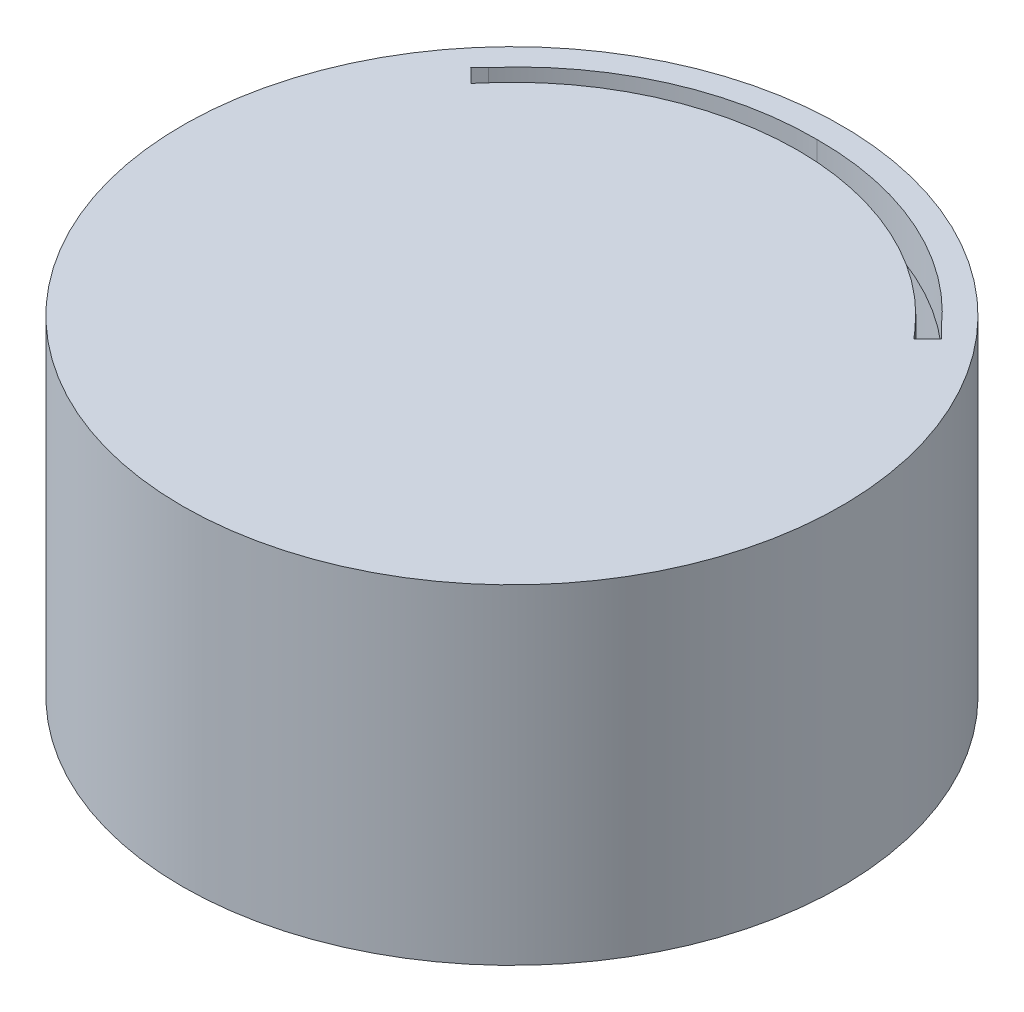
ISO-10303-21;
HEADER;
FILE_DESCRIPTION(('STEP AP214'),'2;1');
FILE_NAME('part.step','',(''),(''),'','','');
FILE_SCHEMA(('AUTOMOTIVE_DESIGN { 1 0 10303 214 1 1 1 1 }'));
ENDSEC;
DATA;
#1=APPLICATION_CONTEXT('core data for automotive mechanical design processes');
#2=APPLICATION_PROTOCOL_DEFINITION('international standard','automotive_design',2000,#1);
#3=PRODUCT_CONTEXT('',#1,'mechanical');
#4=PRODUCT('Part','Part','',(#3));
#5=PRODUCT_RELATED_PRODUCT_CATEGORY('part','',(#4));
#6=PRODUCT_DEFINITION_FORMATION('','',#4);
#7=PRODUCT_DEFINITION_CONTEXT('part definition',#1,'design');
#8=PRODUCT_DEFINITION('design','',#6,#7);
#9=PRODUCT_DEFINITION_SHAPE('','',#8);
#10=(LENGTH_UNIT() NAMED_UNIT(*) SI_UNIT(.MILLI.,.METRE.));
#11=(NAMED_UNIT(*) PLANE_ANGLE_UNIT() SI_UNIT($,.RADIAN.));
#12=(NAMED_UNIT(*) SI_UNIT($,.STERADIAN.) SOLID_ANGLE_UNIT());
#13=UNCERTAINTY_MEASURE_WITH_UNIT(LENGTH_MEASURE(1.E-05),#10,'distance_accuracy_value','');
#14=(GEOMETRIC_REPRESENTATION_CONTEXT(3) GLOBAL_UNCERTAINTY_ASSIGNED_CONTEXT((#13)) GLOBAL_UNIT_ASSIGNED_CONTEXT((#10,
#11,#12)) REPRESENTATION_CONTEXT('',''));
#15=CARTESIAN_POINT('',(0.,0.,0.));
#16=DIRECTION('',(0.,0.,1.));
#17=DIRECTION('',(1.,0.,0.));
#18=AXIS2_PLACEMENT_3D('',#15,#16,#17);
#19=CARTESIAN_POINT('',(0.,30.,0.));
#20=DIRECTION('',(0.,1.,0.));
#21=DIRECTION('',(0.,0.,1.));
#22=AXIS2_PLACEMENT_3D('',#19,#20,#21);
#23=PLANE('',#22);
#24=CARTESIAN_POINT('',(0.,30.,0.));
#25=DIRECTION('',(0.,1.,0.));
#26=DIRECTION('',(0.,0.,1.));
#27=AXIS2_PLACEMENT_3D('',#24,#25,#26);
#28=CIRCLE('',#27,30.);
#29=CARTESIAN_POINT('',(0.,30.,30.));
#30=VERTEX_POINT('',#29);
#31=EDGE_CURVE('E150',#30,#30,#28,.T.);
#32=ORIENTED_EDGE('',*,*,#31,.T.);
#33=EDGE_LOOP('',(#32));
#34=FACE_BOUND('',#33,.T.);
#35=CARTESIAN_POINT('',(-0.269476232128927,30.,-0.813193995065218));
#36=DIRECTION('',(0.,1.,0.));
#37=DIRECTION('',(0.,0.,1.));
#38=AXIS2_PLACEMENT_3D('',#35,#36,#37);
#39=CIRCLE('',#38,26.9706805768212);
#40=CARTESIAN_POINT('',(-0.0254023069730041,30.,-27.7827701633327));
#41=VERTEX_POINT('',#40);
#42=CARTESIAN_POINT('',(-20.6220749338951,30.,-18.5103501751351));
#43=VERTEX_POINT('',#42);
#44=EDGE_CURVE('E126',#41,#43,#39,.T.);
#45=ORIENTED_EDGE('',*,*,#44,.F.);
#46=CARTESIAN_POINT('',(0.218671618182906,30.,-0.813193995065218));
#47=DIRECTION('',(0.,1.,0.));
#48=DIRECTION('',(0.,0.,1.));
#49=AXIS2_PLACEMENT_3D('',#46,#47,#48);
#50=CIRCLE('',#49,26.9706805768212);
#51=CARTESIAN_POINT('',(20.5712703199491,30.,-18.5103501751351));
#52=VERTEX_POINT('',#51);
#53=EDGE_CURVE('E114',#41,#52,#50,.F.);
#54=ORIENTED_EDGE('',*,*,#53,.T.);
#55=DIRECTION('',(-0.707106781186542,0.,-0.707106781186554));
#56=VECTOR('',#55,1.);
#57=CARTESIAN_POINT('',(19.5408102475423,30.,-19.540810247542));
#58=LINE('',#57,#56);
#59=CARTESIAN_POINT('',(21.3902384528601,30.,-17.6913820422241));
#60=VERTEX_POINT('',#59);
#61=EDGE_CURVE('E120',#60,#52,#58,.T.);
#62=ORIENTED_EDGE('',*,*,#61,.F.);
#63=DIRECTION('',(-0.715524800333269,0.,0.698587331768932));
#64=VECTOR('',#63,1.);
#65=CARTESIAN_POINT('',(1.59580190612503,30.,1.63449262293414));
#66=LINE('',#65,#64);
#67=CARTESIAN_POINT('',(20.1244711318793,30.,-16.4555771966164));
#68=VERTEX_POINT('',#67);
#69=EDGE_CURVE('E210',#60,#68,#66,.T.);
#70=ORIENTED_EDGE('',*,*,#69,.T.);
#71=DIRECTION('',(-0.654896156385466,0.,-0.755718879181633));
#72=VECTOR('',#71,1.);
#73=CARTESIAN_POINT('',(19.6374586279711,30.,-17.0175663608715));
#74=LINE('',#73,#72);
#75=CARTESIAN_POINT('',(19.5005232357283,30.,-17.1755832619283));
#76=VERTEX_POINT('',#75);
#77=EDGE_CURVE('E214',#68,#76,#74,.T.);
#78=ORIENTED_EDGE('',*,*,#77,.T.);
#79=CARTESIAN_POINT('',(-0.0653695292751055,30.,-0.0864662667465453));
#80=DIRECTION('',(0.,1.,0.));
#81=DIRECTION('',(0.,0.,1.));
#82=AXIS2_PLACEMENT_3D('',#79,#80,#81);
#83=CIRCLE('',#82,25.978107694107);
#84=CARTESIAN_POINT('',(-0.0254023069730072,30.,-26.0645432161238));
#85=VERTEX_POINT('',#84);
#86=EDGE_CURVE('E218',#85,#76,#83,.F.);
#87=ORIENTED_EDGE('',*,*,#86,.F.);
#88=CARTESIAN_POINT('',(0.014564915329085,30.,-0.0864662667465453));
#89=DIRECTION('',(0.,1.,0.));
#90=DIRECTION('',(0.,0.,1.));
#91=AXIS2_PLACEMENT_3D('',#88,#89,#90);
#92=CIRCLE('',#91,25.978107694107);
#93=CARTESIAN_POINT('',(-19.5513278496743,30.,-17.1755832619283));
#94=VERTEX_POINT('',#93);
#95=EDGE_CURVE('E221',#85,#94,#92,.T.);
#96=ORIENTED_EDGE('',*,*,#95,.T.);
#97=DIRECTION('',(0.654896156385466,0.,-0.755718879181633));
#98=VECTOR('',#97,1.);
#99=CARTESIAN_POINT('',(-19.6664737030836,30.,-17.0427104477693));
#100=LINE('',#99,#98);
#101=CARTESIAN_POINT('',(-20.1752757458253,30.,-16.4555771966164));
#102=VERTEX_POINT('',#101);
#103=EDGE_CURVE('E225',#102,#94,#100,.T.);
#104=ORIENTED_EDGE('',*,*,#103,.F.);
#105=DIRECTION('',(0.715524800333269,0.,0.698587331768932));
#106=VECTOR('',#105,1.);
#107=CARTESIAN_POINT('',(-1.62059579025611,30.,1.65988764254816));
#108=LINE('',#107,#106);
#109=CARTESIAN_POINT('',(-21.4410430668062,30.,-17.6913820422241));
#110=VERTEX_POINT('',#109);
#111=EDGE_CURVE('E142',#110,#102,#108,.T.);
#112=ORIENTED_EDGE('',*,*,#111,.F.);
#113=DIRECTION('',(0.707106781186542,0.,-0.707106781186554));
#114=VECTOR('',#113,1.);
#115=CARTESIAN_POINT('',(-19.5662125545153,30.,-19.566212554515));
#116=LINE('',#115,#114);
#117=EDGE_CURVE('E133',#110,#43,#116,.T.);
#118=ORIENTED_EDGE('',*,*,#117,.T.);
#119=EDGE_LOOP('',(#45,#54,#62,#70,#78,#87,#96,#104,#112,#118));
#120=FACE_BOUND('',#119,.T.);
#121=ADVANCED_FACE('F39',(#34,#120),#23,.T.);
#122=CARTESIAN_POINT('',(0.,26.,0.));
#123=DIRECTION('',(0.,1.,0.));
#124=DIRECTION('',(0.,0.,1.));
#125=AXIS2_PLACEMENT_3D('',#122,#123,#124);
#126=PLANE('',#125);
#127=CARTESIAN_POINT('',(0.,26.,0.));
#128=DIRECTION('',(0.,1.,0.));
#129=DIRECTION('',(0.,0.,1.));
#130=AXIS2_PLACEMENT_3D('',#127,#128,#129);
#131=CIRCLE('',#130,29.);
#132=CARTESIAN_POINT('',(0.,26.,29.));
#133=VERTEX_POINT('',#132);
#134=EDGE_CURVE('E140',#133,#133,#131,.T.);
#135=ORIENTED_EDGE('',*,*,#134,.F.);
#136=EDGE_LOOP('',(#135));
#137=FACE_BOUND('',#136,.T.);
#138=CARTESIAN_POINT('',(0.218671618182906,26.,-0.813193995065218));
#139=DIRECTION('',(0.,1.,0.));
#140=DIRECTION('',(0.,0.,1.));
#141=AXIS2_PLACEMENT_3D('',#138,#139,#140);
#142=CIRCLE('',#141,26.9706805768212);
#143=CARTESIAN_POINT('',(-0.0254023069730041,26.,-27.7827701633327));
#144=VERTEX_POINT('',#143);
#145=CARTESIAN_POINT('',(20.5712703199491,26.,-18.5103501751351));
#146=VERTEX_POINT('',#145);
#147=EDGE_CURVE('E154',#144,#146,#142,.F.);
#148=ORIENTED_EDGE('',*,*,#147,.F.);
#149=CARTESIAN_POINT('',(-0.269476232128927,26.,-0.813193995065218));
#150=DIRECTION('',(0.,1.,0.));
#151=DIRECTION('',(0.,0.,1.));
#152=AXIS2_PLACEMENT_3D('',#149,#150,#151);
#153=CIRCLE('',#152,26.9706805768212);
#154=CARTESIAN_POINT('',(-20.6220749338951,26.,-18.5103501751351));
#155=VERTEX_POINT('',#154);
#156=EDGE_CURVE('E11',#144,#155,#153,.T.);
#157=ORIENTED_EDGE('',*,*,#156,.T.);
#158=DIRECTION('',(0.707106781186542,0.,-0.707106781186554));
#159=VECTOR('',#158,1.);
#160=CARTESIAN_POINT('',(-19.5662125545153,26.,-19.566212554515));
#161=LINE('',#160,#159);
#162=CARTESIAN_POINT('',(-21.4410430668062,26.,-17.6913820422241));
#163=VERTEX_POINT('',#162);
#164=EDGE_CURVE('E48',#163,#155,#161,.T.);
#165=ORIENTED_EDGE('',*,*,#164,.F.);
#166=DIRECTION('',(0.715524800333269,0.,0.698587331768932));
#167=VECTOR('',#166,1.);
#168=CARTESIAN_POINT('',(-1.62059579025611,26.,1.65988764254816));
#169=LINE('',#168,#167);
#170=CARTESIAN_POINT('',(-20.1752757458253,26.,-16.4555771966164));
#171=VERTEX_POINT('',#170);
#172=EDGE_CURVE('E181',#163,#171,#169,.T.);
#173=ORIENTED_EDGE('',*,*,#172,.T.);
#174=DIRECTION('',(0.654896156385466,0.,-0.755718879181633));
#175=VECTOR('',#174,1.);
#176=CARTESIAN_POINT('',(-19.6664737030836,26.,-17.0427104477693));
#177=LINE('',#176,#175);
#178=CARTESIAN_POINT('',(-19.5513278496743,26.,-17.1755832619283));
#179=VERTEX_POINT('',#178);
#180=EDGE_CURVE('E177',#171,#179,#177,.T.);
#181=ORIENTED_EDGE('',*,*,#180,.T.);
#182=CARTESIAN_POINT('',(0.014564915329085,26.,-0.0864662667465453));
#183=DIRECTION('',(0.,1.,0.));
#184=DIRECTION('',(0.,0.,1.));
#185=AXIS2_PLACEMENT_3D('',#182,#183,#184);
#186=CIRCLE('',#185,25.978107694107);
#187=CARTESIAN_POINT('',(-0.0254023069730072,26.,-26.0645432161238));
#188=VERTEX_POINT('',#187);
#189=EDGE_CURVE('E174',#188,#179,#186,.T.);
#190=ORIENTED_EDGE('',*,*,#189,.F.);
#191=CARTESIAN_POINT('',(-0.0653695292751055,26.,-0.0864662667465453));
#192=DIRECTION('',(0.,1.,0.));
#193=DIRECTION('',(0.,0.,1.));
#194=AXIS2_PLACEMENT_3D('',#191,#192,#193);
#195=CIRCLE('',#194,25.978107694107);
#196=CARTESIAN_POINT('',(19.5005232357283,26.,-17.1755832619283));
#197=VERTEX_POINT('',#196);
#198=EDGE_CURVE('E170',#188,#197,#195,.F.);
#199=ORIENTED_EDGE('',*,*,#198,.T.);
#200=DIRECTION('',(-0.654896156385466,0.,-0.755718879181633));
#201=VECTOR('',#200,1.);
#202=CARTESIAN_POINT('',(19.6374586279711,26.,-17.0175663608715));
#203=LINE('',#202,#201);
#204=CARTESIAN_POINT('',(20.1244711318793,26.,-16.4555771966164));
#205=VERTEX_POINT('',#204);
#206=EDGE_CURVE('E167',#205,#197,#203,.T.);
#207=ORIENTED_EDGE('',*,*,#206,.F.);
#208=DIRECTION('',(-0.715524800333269,0.,0.698587331768932));
#209=VECTOR('',#208,1.);
#210=CARTESIAN_POINT('',(1.59580190612503,26.,1.63449262293414));
#211=LINE('',#210,#209);
#212=CARTESIAN_POINT('',(21.3902384528601,26.,-17.6913820422241));
#213=VERTEX_POINT('',#212);
#214=EDGE_CURVE('E164',#213,#205,#211,.T.);
#215=ORIENTED_EDGE('',*,*,#214,.F.);
#216=DIRECTION('',(-0.707106781186542,0.,-0.707106781186554));
#217=VECTOR('',#216,1.);
#218=CARTESIAN_POINT('',(19.5408102475423,26.,-19.540810247542));
#219=LINE('',#218,#217);
#220=EDGE_CURVE('E160',#213,#146,#219,.T.);
#221=ORIENTED_EDGE('',*,*,#220,.T.);
#222=EDGE_LOOP('',(#148,#157,#165,#173,#181,#190,#199,#207,#215,#221));
#223=FACE_BOUND('',#222,.T.);
#224=ADVANCED_FACE('F194',(#137,#223),#126,.F.);
#225=CARTESIAN_POINT('',(0.,30.,0.));
#226=DIRECTION('',(0.,-1.,0.));
#227=DIRECTION('',(0.,0.,-1.));
#228=AXIS2_PLACEMENT_3D('',#225,#226,#227);
#229=CYLINDRICAL_SURFACE('',#228,30.);
#230=ORIENTED_EDGE('',*,*,#31,.F.);
#231=EDGE_LOOP('',(#230));
#232=FACE_BOUND('',#231,.T.);
#233=CARTESIAN_POINT('',(0.,0.,0.));
#234=DIRECTION('',(0.,1.,0.));
#235=DIRECTION('',(0.,0.,1.));
#236=AXIS2_PLACEMENT_3D('',#233,#234,#235);
#237=CIRCLE('',#236,30.);
#238=CARTESIAN_POINT('',(0.,0.,30.));
#239=VERTEX_POINT('',#238);
#240=EDGE_CURVE('E148',#239,#239,#237,.T.);
#241=ORIENTED_EDGE('',*,*,#240,.T.);
#242=EDGE_LOOP('',(#241));
#243=FACE_BOUND('',#242,.T.);
#244=ADVANCED_FACE('F41',(#232,#243),#229,.T.);
#245=CARTESIAN_POINT('',(0.,0.,0.));
#246=DIRECTION('',(0.,1.,0.));
#247=DIRECTION('',(0.,0.,1.));
#248=AXIS2_PLACEMENT_3D('',#245,#246,#247);
#249=PLANE('',#248);
#250=CARTESIAN_POINT('',(0.,0.,0.));
#251=DIRECTION('',(0.,1.,0.));
#252=DIRECTION('',(0.,0.,1.));
#253=AXIS2_PLACEMENT_3D('',#250,#251,#252);
#254=CIRCLE('',#253,29.);
#255=CARTESIAN_POINT('',(0.,0.,29.));
#256=VERTEX_POINT('',#255);
#257=EDGE_CURVE('E135',#256,#256,#254,.T.);
#258=ORIENTED_EDGE('',*,*,#257,.T.);
#259=EDGE_LOOP('',(#258));
#260=FACE_BOUND('',#259,.T.);
#261=ORIENTED_EDGE('',*,*,#240,.F.);
#262=EDGE_LOOP('',(#261));
#263=FACE_BOUND('',#262,.T.);
#264=ADVANCED_FACE('F285',(#260,#263),#249,.F.);
#265=CARTESIAN_POINT('',(0.,26.,0.));
#266=DIRECTION('',(0.,-1.,0.));
#267=DIRECTION('',(0.,0.,-1.));
#268=AXIS2_PLACEMENT_3D('',#265,#266,#267);
#269=CYLINDRICAL_SURFACE('',#268,29.);
#270=ORIENTED_EDGE('',*,*,#134,.T.);
#271=EDGE_LOOP('',(#270));
#272=FACE_BOUND('',#271,.T.);
#273=ORIENTED_EDGE('',*,*,#257,.F.);
#274=EDGE_LOOP('',(#273));
#275=FACE_BOUND('',#274,.T.);
#276=ADVANCED_FACE('F284',(#272,#275),#269,.F.);
#277=CARTESIAN_POINT('',(-0.269476232128927,74.,-0.813193995065218));
#278=DIRECTION('',(0.,-1.,0.));
#279=DIRECTION('',(0.,0.,-1.));
#280=AXIS2_PLACEMENT_3D('',#277,#278,#279);
#281=CYLINDRICAL_SURFACE('',#280,26.9706805768212);
#282=ORIENTED_EDGE('',*,*,#44,.T.);
#283=DIRECTION('',(0.,-1.,0.));
#284=VECTOR('',#283,1.);
#285=CARTESIAN_POINT('',(-20.6220749338951,74.,-18.5103501751351));
#286=LINE('',#285,#284);
#287=EDGE_CURVE('E121',#43,#155,#286,.T.);
#288=ORIENTED_EDGE('',*,*,#287,.T.);
#289=ORIENTED_EDGE('',*,*,#156,.F.);
#290=DIRECTION('',(0.,-1.,0.));
#291=VECTOR('',#290,1.);
#292=CARTESIAN_POINT('',(-0.0254023069730041,74.,-27.7827701633327));
#293=LINE('',#292,#291);
#294=EDGE_CURVE('E60',#41,#144,#293,.T.);
#295=ORIENTED_EDGE('',*,*,#294,.F.);
#296=EDGE_LOOP('',(#282,#288,#289,#295));
#297=FACE_BOUND('',#296,.T.);
#298=ADVANCED_FACE('F124',(#297),#281,.F.);
#299=CARTESIAN_POINT('',(-20.6220749338951,74.,-18.5103501751351));
#300=DIRECTION('',(0.707106781186554,0.,0.707106781186542));
#301=DIRECTION('',(0.707106781186542,0.,-0.707106781186554));
#302=AXIS2_PLACEMENT_3D('',#299,#300,#301);
#303=PLANE('',#302);
#304=DIRECTION('',(0.,-1.,0.));
#305=VECTOR('',#304,1.);
#306=CARTESIAN_POINT('',(-21.4410430668062,74.,-17.6913820422241));
#307=LINE('',#306,#305);
#308=EDGE_CURVE('E190',#110,#163,#307,.T.);
#309=ORIENTED_EDGE('',*,*,#308,.T.);
#310=ORIENTED_EDGE('',*,*,#164,.T.);
#311=ORIENTED_EDGE('',*,*,#287,.F.);
#312=ORIENTED_EDGE('',*,*,#117,.F.);
#313=EDGE_LOOP('',(#309,#310,#311,#312));
#314=FACE_BOUND('',#313,.T.);
#315=ADVANCED_FACE('F188',(#314),#303,.T.);
#316=CARTESIAN_POINT('',(-20.1752757458253,74.,-16.4555771966164));
#317=DIRECTION('',(-0.698587331768932,0.,0.715524800333269));
#318=DIRECTION('',(0.715524800333269,0.,0.698587331768932));
#319=AXIS2_PLACEMENT_3D('',#316,#317,#318);
#320=PLANE('',#319);
#321=ORIENTED_EDGE('',*,*,#111,.T.);
#322=DIRECTION('',(0.,-1.,0.));
#323=VECTOR('',#322,1.);
#324=CARTESIAN_POINT('',(-20.1752757458253,74.,-16.4555771966164));
#325=LINE('',#324,#323);
#326=EDGE_CURVE('E232',#102,#171,#325,.T.);
#327=ORIENTED_EDGE('',*,*,#326,.T.);
#328=ORIENTED_EDGE('',*,*,#172,.F.);
#329=ORIENTED_EDGE('',*,*,#308,.F.);
#330=EDGE_LOOP('',(#321,#327,#328,#329));
#331=FACE_BOUND('',#330,.T.);
#332=ADVANCED_FACE('F231',(#331),#320,.F.);
#333=CARTESIAN_POINT('',(-19.5513278496743,74.,-17.1755832619283));
#334=DIRECTION('',(0.755718879181633,0.,0.654896156385466));
#335=DIRECTION('',(0.654896156385466,0.,-0.755718879181633));
#336=AXIS2_PLACEMENT_3D('',#333,#334,#335);
#337=PLANE('',#336);
#338=ORIENTED_EDGE('',*,*,#103,.T.);
#339=DIRECTION('',(0.,-1.,0.));
#340=VECTOR('',#339,1.);
#341=CARTESIAN_POINT('',(-19.5513278496743,74.,-17.1755832619283));
#342=LINE('',#341,#340);
#343=EDGE_CURVE('E239',#94,#179,#342,.T.);
#344=ORIENTED_EDGE('',*,*,#343,.T.);
#345=ORIENTED_EDGE('',*,*,#180,.F.);
#346=ORIENTED_EDGE('',*,*,#326,.F.);
#347=EDGE_LOOP('',(#338,#344,#345,#346));
#348=FACE_BOUND('',#347,.T.);
#349=ADVANCED_FACE('F235',(#348),#337,.F.);
#350=CARTESIAN_POINT('',(0.014564915329085,74.,-0.0864662667465453));
#351=DIRECTION('',(0.,-1.,0.));
#352=DIRECTION('',(0.,0.,-1.));
#353=AXIS2_PLACEMENT_3D('',#350,#351,#352);
#354=CYLINDRICAL_SURFACE('',#353,25.978107694107);
#355=DIRECTION('',(0.,-1.,0.));
#356=VECTOR('',#355,1.);
#357=CARTESIAN_POINT('',(-0.0254023069730072,74.,-26.0645432161238));
#358=LINE('',#357,#356);
#359=EDGE_CURVE('E246',#85,#188,#358,.T.);
#360=ORIENTED_EDGE('',*,*,#359,.T.);
#361=ORIENTED_EDGE('',*,*,#189,.T.);
#362=ORIENTED_EDGE('',*,*,#343,.F.);
#363=ORIENTED_EDGE('',*,*,#95,.F.);
#364=EDGE_LOOP('',(#360,#361,#362,#363));
#365=FACE_BOUND('',#364,.T.);
#366=ADVANCED_FACE('F245',(#365),#354,.T.);
#367=CARTESIAN_POINT('',(-0.0653695292751055,74.,-0.0864662667465453));
#368=DIRECTION('',(0.,-1.,0.));
#369=DIRECTION('',(0.,0.,-1.));
#370=AXIS2_PLACEMENT_3D('',#367,#368,#369);
#371=CYLINDRICAL_SURFACE('',#370,25.978107694107);
#372=ORIENTED_EDGE('',*,*,#86,.T.);
#373=DIRECTION('',(0.,-1.,0.));
#374=VECTOR('',#373,1.);
#375=CARTESIAN_POINT('',(19.5005232357283,74.,-17.1755832619283));
#376=LINE('',#375,#374);
#377=EDGE_CURVE('E253',#76,#197,#376,.T.);
#378=ORIENTED_EDGE('',*,*,#377,.T.);
#379=ORIENTED_EDGE('',*,*,#198,.F.);
#380=ORIENTED_EDGE('',*,*,#359,.F.);
#381=EDGE_LOOP('',(#372,#378,#379,#380));
#382=FACE_BOUND('',#381,.T.);
#383=ADVANCED_FACE('F249',(#382),#371,.T.);
#384=CARTESIAN_POINT('',(19.5005232357283,74.,-17.1755832619283));
#385=DIRECTION('',(0.755718879181633,0.,-0.654896156385466));
#386=DIRECTION('',(-0.654896156385466,0.,-0.755718879181633));
#387=AXIS2_PLACEMENT_3D('',#384,#385,#386);
#388=PLANE('',#387);
#389=DIRECTION('',(0.,-1.,0.));
#390=VECTOR('',#389,1.);
#391=CARTESIAN_POINT('',(20.1244711318793,74.,-16.4555771966164));
#392=LINE('',#391,#390);
#393=EDGE_CURVE('E204',#68,#205,#392,.T.);
#394=ORIENTED_EDGE('',*,*,#393,.T.);
#395=ORIENTED_EDGE('',*,*,#206,.T.);
#396=ORIENTED_EDGE('',*,*,#377,.F.);
#397=ORIENTED_EDGE('',*,*,#77,.F.);
#398=EDGE_LOOP('',(#394,#395,#396,#397));
#399=FACE_BOUND('',#398,.T.);
#400=ADVANCED_FACE('F264',(#399),#388,.T.);
#401=CARTESIAN_POINT('',(20.1244711318793,74.,-16.4555771966164));
#402=DIRECTION('',(-0.698587331768932,0.,-0.715524800333269));
#403=DIRECTION('',(-0.715524800333269,0.,0.698587331768932));
#404=AXIS2_PLACEMENT_3D('',#401,#402,#403);
#405=PLANE('',#404);
#406=DIRECTION('',(0.,-1.,0.));
#407=VECTOR('',#406,1.);
#408=CARTESIAN_POINT('',(21.3902384528601,74.,-17.6913820422241));
#409=LINE('',#408,#407);
#410=EDGE_CURVE('E201',#60,#213,#409,.T.);
#411=ORIENTED_EDGE('',*,*,#410,.T.);
#412=ORIENTED_EDGE('',*,*,#214,.T.);
#413=ORIENTED_EDGE('',*,*,#393,.F.);
#414=ORIENTED_EDGE('',*,*,#69,.F.);
#415=EDGE_LOOP('',(#411,#412,#413,#414));
#416=FACE_BOUND('',#415,.T.);
#417=ADVANCED_FACE('F266',(#416),#405,.T.);
#418=CARTESIAN_POINT('',(20.5712703199491,74.,-18.5103501751351));
#419=DIRECTION('',(0.707106781186554,0.,-0.707106781186542));
#420=DIRECTION('',(-0.707106781186542,0.,-0.707106781186554));
#421=AXIS2_PLACEMENT_3D('',#418,#419,#420);
#422=PLANE('',#421);
#423=ORIENTED_EDGE('',*,*,#61,.T.);
#424=DIRECTION('',(0.,-1.,0.));
#425=VECTOR('',#424,1.);
#426=CARTESIAN_POINT('',(20.5712703199491,74.,-18.5103501751351));
#427=LINE('',#426,#425);
#428=EDGE_CURVE('E55',#52,#146,#427,.T.);
#429=ORIENTED_EDGE('',*,*,#428,.T.);
#430=ORIENTED_EDGE('',*,*,#220,.F.);
#431=ORIENTED_EDGE('',*,*,#410,.F.);
#432=EDGE_LOOP('',(#423,#429,#430,#431));
#433=FACE_BOUND('',#432,.T.);
#434=ADVANCED_FACE('F197',(#433),#422,.F.);
#435=CARTESIAN_POINT('',(0.218671618182906,74.,-0.813193995065218));
#436=DIRECTION('',(0.,-1.,0.));
#437=DIRECTION('',(0.,0.,-1.));
#438=AXIS2_PLACEMENT_3D('',#435,#436,#437);
#439=CYLINDRICAL_SURFACE('',#438,26.9706805768212);
#440=ORIENTED_EDGE('',*,*,#294,.T.);
#441=ORIENTED_EDGE('',*,*,#147,.T.);
#442=ORIENTED_EDGE('',*,*,#428,.F.);
#443=ORIENTED_EDGE('',*,*,#53,.F.);
#444=EDGE_LOOP('',(#440,#441,#442,#443));
#445=FACE_BOUND('',#444,.T.);
#446=ADVANCED_FACE('F115',(#445),#439,.F.);
#447=CLOSED_SHELL('',(#121,#224,#244,#264,#276,#298,#315,#332,#349,#366,#383,#400,#417,#434,#446));
#448=MANIFOLD_SOLID_BREP('B2',#447);
#449=ADVANCED_BREP_SHAPE_REPRESENTATION('',(#18,#448),#14);
#450=SHAPE_DEFINITION_REPRESENTATION(#9,#449);
ENDSEC;
END-ISO-10303-21;
